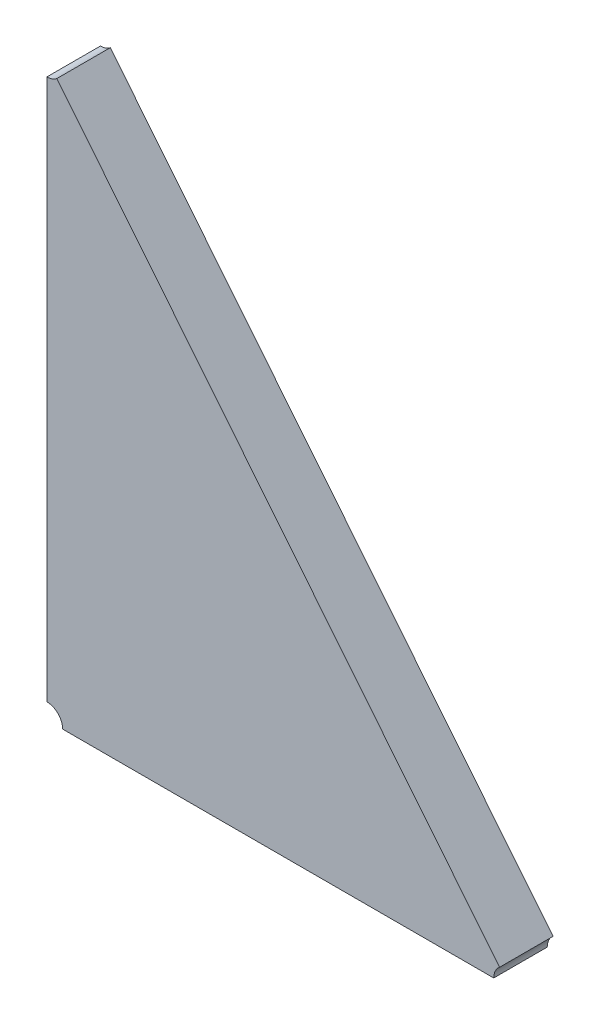
ISO-10303-21;
HEADER;
FILE_DESCRIPTION(('STEP AP214'),'2;1');
FILE_NAME('part.step','',(''),(''),'','','');
FILE_SCHEMA(('AUTOMOTIVE_DESIGN { 1 0 10303 214 1 1 1 1 }'));
ENDSEC;
DATA;
#1=APPLICATION_CONTEXT('core data for automotive mechanical design processes');
#2=APPLICATION_PROTOCOL_DEFINITION('international standard','automotive_design',2000,#1);
#3=PRODUCT_CONTEXT('',#1,'mechanical');
#4=PRODUCT('Part','Part','',(#3));
#5=PRODUCT_RELATED_PRODUCT_CATEGORY('part','',(#4));
#6=PRODUCT_DEFINITION_FORMATION('','',#4);
#7=PRODUCT_DEFINITION_CONTEXT('part definition',#1,'design');
#8=PRODUCT_DEFINITION('design','',#6,#7);
#9=PRODUCT_DEFINITION_SHAPE('','',#8);
#10=(LENGTH_UNIT() NAMED_UNIT(*) SI_UNIT(.MILLI.,.METRE.));
#11=(NAMED_UNIT(*) PLANE_ANGLE_UNIT() SI_UNIT($,.RADIAN.));
#12=(NAMED_UNIT(*) SI_UNIT($,.STERADIAN.) SOLID_ANGLE_UNIT());
#13=UNCERTAINTY_MEASURE_WITH_UNIT(LENGTH_MEASURE(1.E-05),#10,'distance_accuracy_value','');
#14=(GEOMETRIC_REPRESENTATION_CONTEXT(3) GLOBAL_UNCERTAINTY_ASSIGNED_CONTEXT((#13)) GLOBAL_UNIT_ASSIGNED_CONTEXT((#10,
#11,#12)) REPRESENTATION_CONTEXT('',''));
#15=CARTESIAN_POINT('',(0.,0.,0.));
#16=DIRECTION('',(0.,0.,1.));
#17=DIRECTION('',(1.,0.,0.));
#18=AXIS2_PLACEMENT_3D('',#15,#16,#17);
#19=CARTESIAN_POINT('',(-1.30053377535013,-1.33390159204412,0.0042));
#20=DIRECTION('',(0.,0.,1.));
#21=DIRECTION('',(1.,0.,0.));
#22=AXIS2_PLACEMENT_3D('',#19,#20,#21);
#23=PLANE('',#22);
#24=CARTESIAN_POINT('',(-1.31045874865729,-1.34730973343148,0.0042));
#25=DIRECTION('',(0.,0.,-1.));
#26=DIRECTION('',(0.,1.,0.));
#27=AXIS2_PLACEMENT_3D('',#24,#25,#26);
#28=CIRCLE('',#27,0.001);
#29=CARTESIAN_POINT('',(-1.31045874865729,-1.34630973343148,0.0042));
#30=VERTEX_POINT('',#29);
#31=CARTESIAN_POINT('',(-1.30945874865729,-1.34730973343148,0.0042));
#32=VERTEX_POINT('',#31);
#33=EDGE_CURVE('E11',#30,#32,#28,.T.);
#34=ORIENTED_EDGE('',*,*,#33,.T.);
#35=DIRECTION('',(1.,0.,0.));
#36=VECTOR('',#35,1.);
#37=CARTESIAN_POINT('',(-1.30945874865729,-1.34730973343148,0.0042));
#38=LINE('',#37,#36);
#39=CARTESIAN_POINT('',(-1.28205513012271,-1.34730973343148,0.0042));
#40=VERTEX_POINT('',#39);
#41=EDGE_CURVE('E83',#32,#40,#38,.T.);
#42=ORIENTED_EDGE('',*,*,#41,.T.);
#43=CARTESIAN_POINT('',(-1.28105513012271,-1.34730973343148,0.0042));
#44=DIRECTION('',(0.,0.,-1.));
#45=DIRECTION('',(-1.,0.,0.));
#46=AXIS2_PLACEMENT_3D('',#43,#44,#45);
#47=CIRCLE('',#46,0.000999999999999999);
#48=CARTESIAN_POINT('',(-1.28168341933116,-1.34653175356635,0.0042));
#49=VERTEX_POINT('',#48);
#50=EDGE_CURVE('E107',#40,#49,#47,.T.);
#51=ORIENTED_EDGE('',*,*,#50,.T.);
#52=DIRECTION('',(-0.628289208450209,0.777979865128276,0.));
#53=VECTOR('',#52,1.);
#54=CARTESIAN_POINT('',(-1.28168341933116,-1.34653175356635,0.0042));
#55=LINE('',#54,#53);
#56=CARTESIAN_POINT('',(-1.30983045944884,-1.31167864741715,0.0042));
#57=VERTEX_POINT('',#56);
#58=EDGE_CURVE('E110',#49,#57,#55,.T.);
#59=ORIENTED_EDGE('',*,*,#58,.T.);
#60=CARTESIAN_POINT('',(-1.31045874865729,-1.31090066755203,0.0042));
#61=DIRECTION('',(0.,0.,-1.));
#62=DIRECTION('',(0.628289208454161,-0.777979865125084,0.));
#63=AXIS2_PLACEMENT_3D('',#60,#61,#62);
#64=CIRCLE('',#63,0.00100000000000001);
#65=CARTESIAN_POINT('',(-1.31045874865729,-1.31190066755203,0.0042));
#66=VERTEX_POINT('',#65);
#67=EDGE_CURVE('E74',#57,#66,#64,.T.);
#68=ORIENTED_EDGE('',*,*,#67,.T.);
#69=DIRECTION('',(0.,-1.,0.));
#70=VECTOR('',#69,1.);
#71=CARTESIAN_POINT('',(-1.31045874865729,-1.31190066755203,0.0042));
#72=LINE('',#71,#70);
#73=EDGE_CURVE('E103',#66,#30,#72,.T.);
#74=ORIENTED_EDGE('',*,*,#73,.T.);
#75=EDGE_LOOP('',(#34,#42,#51,#59,#68,#74));
#76=FACE_BOUND('',#75,.T.);
#77=ADVANCED_FACE('F17',(#76),#23,.T.);
#78=CARTESIAN_POINT('',(-1.28105513012271,-1.34730973343148,0.0008));
#79=DIRECTION('',(0.777979865128275,0.628289208450209,0.));
#80=DIRECTION('',(-0.628289208450209,0.777979865128275,0.));
#81=AXIS2_PLACEMENT_3D('',#78,#79,#80);
#82=PLANE('',#81);
#83=DIRECTION('',(0.,-1.30614473485313E-13,1.));
#84=VECTOR('',#83,1.);
#85=CARTESIAN_POINT('',(-1.30983045944884,-1.31167864741715,0.0008));
#86=LINE('',#85,#84);
#87=CARTESIAN_POINT('',(-1.30983045944884,-1.31167864741715,0.0008));
#88=VERTEX_POINT('',#87);
#89=EDGE_CURVE('E24',#88,#57,#86,.T.);
#90=ORIENTED_EDGE('',*,*,#89,.T.);
#91=ORIENTED_EDGE('',*,*,#58,.F.);
#92=DIRECTION('',(0.,0.,-1.));
#93=VECTOR('',#92,1.);
#94=CARTESIAN_POINT('',(-1.28168341933116,-1.34653175356635,0.0042));
#95=LINE('',#94,#93);
#96=CARTESIAN_POINT('',(-1.28168341933116,-1.34653175356635,0.0008));
#97=VERTEX_POINT('',#96);
#98=EDGE_CURVE('E68',#49,#97,#95,.T.);
#99=ORIENTED_EDGE('',*,*,#98,.T.);
#100=DIRECTION('',(-0.628289208450206,0.777979865128278,0.));
#101=VECTOR('',#100,1.);
#102=CARTESIAN_POINT('',(-1.28168341933116,-1.34653175356635,0.0008));
#103=LINE('',#102,#101);
#104=EDGE_CURVE('E65',#97,#88,#103,.T.);
#105=ORIENTED_EDGE('',*,*,#104,.T.);
#106=EDGE_LOOP('',(#90,#91,#99,#105));
#107=FACE_BOUND('',#106,.T.);
#108=ADVANCED_FACE('F66',(#107),#82,.T.);
#109=CARTESIAN_POINT('',(-1.31045874865729,-1.31090066755203,0.0008));
#110=DIRECTION('',(-1.,0.,0.));
#111=DIRECTION('',(0.,-1.,0.));
#112=AXIS2_PLACEMENT_3D('',#109,#110,#111);
#113=PLANE('',#112);
#114=DIRECTION('',(0.,0.,1.));
#115=VECTOR('',#114,1.);
#116=CARTESIAN_POINT('',(-1.31045874865729,-1.34630973343148,0.0008));
#117=LINE('',#116,#115);
#118=CARTESIAN_POINT('',(-1.31045874865729,-1.34630973343148,0.0008));
#119=VERTEX_POINT('',#118);
#120=EDGE_CURVE('E112',#119,#30,#117,.T.);
#121=ORIENTED_EDGE('',*,*,#120,.T.);
#122=ORIENTED_EDGE('',*,*,#73,.F.);
#123=DIRECTION('',(0.,0.,-1.));
#124=VECTOR('',#123,1.);
#125=CARTESIAN_POINT('',(-1.31045874865729,-1.31190066755203,0.0042));
#126=LINE('',#125,#124);
#127=CARTESIAN_POINT('',(-1.31045874865729,-1.31190066755203,0.0008));
#128=VERTEX_POINT('',#127);
#129=EDGE_CURVE('E73',#66,#128,#126,.T.);
#130=ORIENTED_EDGE('',*,*,#129,.T.);
#131=DIRECTION('',(0.,-1.,0.));
#132=VECTOR('',#131,1.);
#133=CARTESIAN_POINT('',(-1.31045874865729,-1.31190066755203,0.0008));
#134=LINE('',#133,#132);
#135=EDGE_CURVE('E87',#128,#119,#134,.T.);
#136=ORIENTED_EDGE('',*,*,#135,.T.);
#137=EDGE_LOOP('',(#121,#122,#130,#136));
#138=FACE_BOUND('',#137,.T.);
#139=ADVANCED_FACE('F126',(#138),#113,.T.);
#140=CARTESIAN_POINT('',(-1.31045874865729,-1.34730973343148,0.0008));
#141=DIRECTION('',(0.,-1.,0.));
#142=DIRECTION('',(1.,0.,0.));
#143=AXIS2_PLACEMENT_3D('',#140,#141,#142);
#144=PLANE('',#143);
#145=DIRECTION('',(0.,0.,-1.));
#146=VECTOR('',#145,1.);
#147=CARTESIAN_POINT('',(-1.30945874865729,-1.34730973343148,0.0042));
#148=LINE('',#147,#146);
#149=CARTESIAN_POINT('',(-1.30945874865729,-1.34730973343148,0.0008));
#150=VERTEX_POINT('',#149);
#151=EDGE_CURVE('E105',#32,#150,#148,.T.);
#152=ORIENTED_EDGE('',*,*,#151,.T.);
#153=DIRECTION('',(1.,0.,0.));
#154=VECTOR('',#153,1.);
#155=CARTESIAN_POINT('',(-1.30945874865729,-1.34730973343148,0.0008));
#156=LINE('',#155,#154);
#157=CARTESIAN_POINT('',(-1.28205513012271,-1.34730973343148,0.0008));
#158=VERTEX_POINT('',#157);
#159=EDGE_CURVE('E98',#150,#158,#156,.T.);
#160=ORIENTED_EDGE('',*,*,#159,.T.);
#161=DIRECTION('',(0.,0.,1.));
#162=VECTOR('',#161,1.);
#163=CARTESIAN_POINT('',(-1.28205513012271,-1.34730973343148,0.0008));
#164=LINE('',#163,#162);
#165=EDGE_CURVE('E88',#158,#40,#164,.T.);
#166=ORIENTED_EDGE('',*,*,#165,.T.);
#167=ORIENTED_EDGE('',*,*,#41,.F.);
#168=EDGE_LOOP('',(#152,#160,#166,#167));
#169=FACE_BOUND('',#168,.T.);
#170=ADVANCED_FACE('F118',(#169),#144,.T.);
#171=CARTESIAN_POINT('',(-1.30051023639926,-1.33385849750101,0.0008));
#172=DIRECTION('',(0.,0.,1.));
#173=DIRECTION('',(1.,0.,0.));
#174=AXIS2_PLACEMENT_3D('',#171,#172,#173);
#175=PLANE('',#174);
#176=CARTESIAN_POINT('',(-1.31045874865729,-1.34730973343148,0.0008));
#177=DIRECTION('',(0.,0.,1.));
#178=DIRECTION('',(1.,0.,0.));
#179=AXIS2_PLACEMENT_3D('',#176,#177,#178);
#180=CIRCLE('',#179,0.001);
#181=EDGE_CURVE('E100',#150,#119,#180,.T.);
#182=ORIENTED_EDGE('',*,*,#181,.T.);
#183=ORIENTED_EDGE('',*,*,#135,.F.);
#184=CARTESIAN_POINT('',(-1.31045874865729,-1.31090066755203,0.0008));
#185=DIRECTION('',(0.,0.,1.));
#186=DIRECTION('',(0.,-1.,0.));
#187=AXIS2_PLACEMENT_3D('',#184,#185,#186);
#188=CIRCLE('',#187,0.00100000000000001);
#189=EDGE_CURVE('E81',#128,#88,#188,.T.);
#190=ORIENTED_EDGE('',*,*,#189,.T.);
#191=ORIENTED_EDGE('',*,*,#104,.F.);
#192=CARTESIAN_POINT('',(-1.28105513012271,-1.34730973343148,0.0008));
#193=DIRECTION('',(0.,0.,1.));
#194=DIRECTION('',(-0.628289208449116,0.777979865129158,0.));
#195=AXIS2_PLACEMENT_3D('',#192,#193,#194);
#196=CIRCLE('',#195,0.000999999999999999);
#197=EDGE_CURVE('E89',#97,#158,#196,.T.);
#198=ORIENTED_EDGE('',*,*,#197,.T.);
#199=ORIENTED_EDGE('',*,*,#159,.F.);
#200=EDGE_LOOP('',(#182,#183,#190,#191,#198,#199));
#201=FACE_BOUND('',#200,.T.);
#202=ADVANCED_FACE('F85',(#201),#175,.F.);
#203=CARTESIAN_POINT('',(-1.28105513012271,-1.34730973343148,0.0012));
#204=DIRECTION('',(0.,0.,1.));
#205=DIRECTION('',(-1.,0.,0.));
#206=AXIS2_PLACEMENT_3D('',#203,#204,#205);
#207=CYLINDRICAL_SURFACE('',#206,0.000999999999999999);
#208=ORIENTED_EDGE('',*,*,#98,.F.);
#209=ORIENTED_EDGE('',*,*,#50,.F.);
#210=ORIENTED_EDGE('',*,*,#165,.F.);
#211=ORIENTED_EDGE('',*,*,#197,.F.);
#212=EDGE_LOOP('',(#208,#209,#210,#211));
#213=FACE_BOUND('',#212,.T.);
#214=ADVANCED_FACE('F121',(#213),#207,.F.);
#215=CARTESIAN_POINT('',(-1.31045874865729,-1.31090066755203,0.0012));
#216=DIRECTION('',(0.,0.,1.));
#217=DIRECTION('',(-1.,0.,0.));
#218=AXIS2_PLACEMENT_3D('',#215,#216,#217);
#219=CYLINDRICAL_SURFACE('',#218,0.00100000000000001);
#220=ORIENTED_EDGE('',*,*,#89,.F.);
#221=ORIENTED_EDGE('',*,*,#189,.F.);
#222=ORIENTED_EDGE('',*,*,#129,.F.);
#223=ORIENTED_EDGE('',*,*,#67,.F.);
#224=EDGE_LOOP('',(#220,#221,#222,#223));
#225=FACE_BOUND('',#224,.T.);
#226=ADVANCED_FACE('F79',(#225),#219,.F.);
#227=CARTESIAN_POINT('',(-1.31045874865729,-1.34730973343148,0.0012));
#228=DIRECTION('',(0.,0.,1.));
#229=DIRECTION('',(-1.,0.,0.));
#230=AXIS2_PLACEMENT_3D('',#227,#228,#229);
#231=CYLINDRICAL_SURFACE('',#230,0.001);
#232=ORIENTED_EDGE('',*,*,#120,.F.);
#233=ORIENTED_EDGE('',*,*,#181,.F.);
#234=ORIENTED_EDGE('',*,*,#151,.F.);
#235=ORIENTED_EDGE('',*,*,#33,.F.);
#236=EDGE_LOOP('',(#232,#233,#234,#235));
#237=FACE_BOUND('',#236,.T.);
#238=ADVANCED_FACE('F127',(#237),#231,.F.);
#239=CLOSED_SHELL('',(#77,#108,#139,#170,#202,#214,#226,#238));
#240=MANIFOLD_SOLID_BREP('B1',#239);
#241=ADVANCED_BREP_SHAPE_REPRESENTATION('',(#18,#240),#14);
#242=SHAPE_DEFINITION_REPRESENTATION(#9,#241);
ENDSEC;
END-ISO-10303-21;
